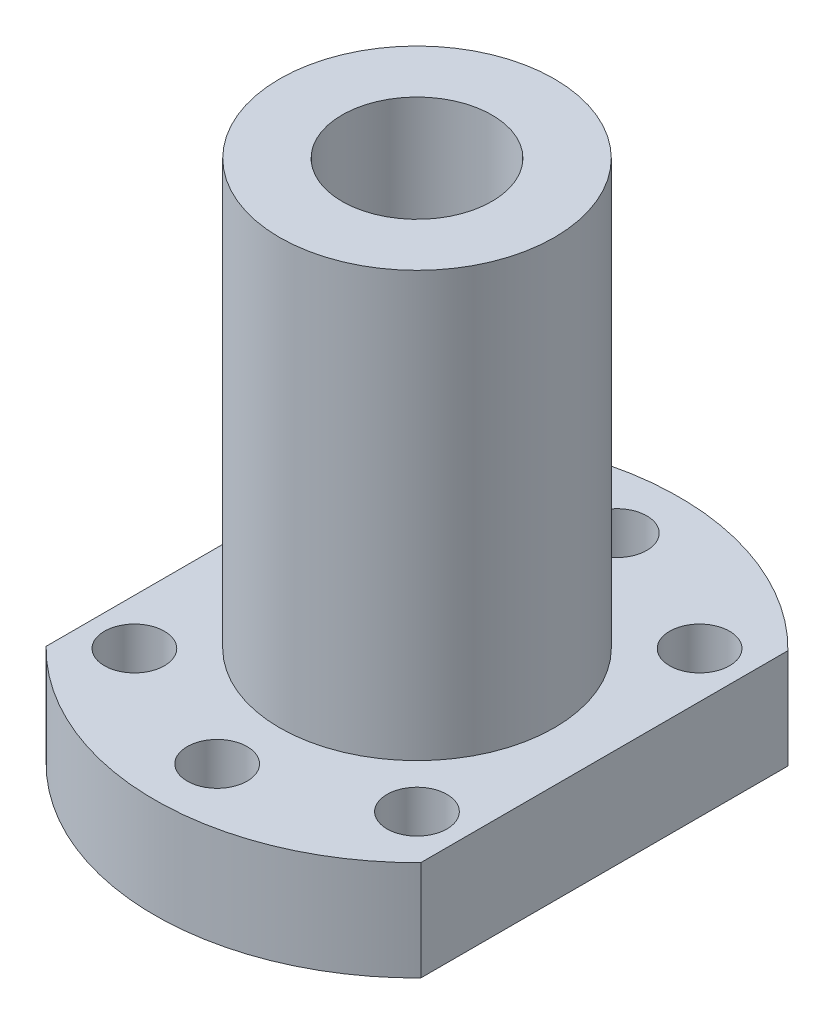
ISO-10303-21;
HEADER;
FILE_DESCRIPTION(('STEP AP214'),'2;1');
FILE_NAME('part.step','',(''),(''),'','','');
FILE_SCHEMA(('AUTOMOTIVE_DESIGN { 1 0 10303 214 1 1 1 1 }'));
ENDSEC;
DATA;
#1=APPLICATION_CONTEXT('core data for automotive mechanical design processes');
#2=APPLICATION_PROTOCOL_DEFINITION('international standard','automotive_design',2000,#1);
#3=PRODUCT_CONTEXT('',#1,'mechanical');
#4=PRODUCT('Part','Part','',(#3));
#5=PRODUCT_RELATED_PRODUCT_CATEGORY('part','',(#4));
#6=PRODUCT_DEFINITION_FORMATION('','',#4);
#7=PRODUCT_DEFINITION_CONTEXT('part definition',#1,'design');
#8=PRODUCT_DEFINITION('design','',#6,#7);
#9=PRODUCT_DEFINITION_SHAPE('','',#8);
#10=(LENGTH_UNIT() NAMED_UNIT(*) SI_UNIT(.MILLI.,.METRE.));
#11=(NAMED_UNIT(*) PLANE_ANGLE_UNIT() SI_UNIT($,.RADIAN.));
#12=(NAMED_UNIT(*) SI_UNIT($,.STERADIAN.) SOLID_ANGLE_UNIT());
#13=UNCERTAINTY_MEASURE_WITH_UNIT(LENGTH_MEASURE(1.E-05),#10,'distance_accuracy_value','');
#14=(GEOMETRIC_REPRESENTATION_CONTEXT(3) GLOBAL_UNCERTAINTY_ASSIGNED_CONTEXT((#13)) GLOBAL_UNIT_ASSIGNED_CONTEXT((#10,
#11,#12)) REPRESENTATION_CONTEXT('',''));
#15=CARTESIAN_POINT('',(0.,0.,0.));
#16=DIRECTION('',(0.,0.,1.));
#17=DIRECTION('',(1.,0.,0.));
#18=AXIS2_PLACEMENT_3D('',#15,#16,#17);
#19=CARTESIAN_POINT('',(15.,8.,0.));
#20=DIRECTION('',(1.,0.,0.));
#21=DIRECTION('',(0.,0.,-1.));
#22=AXIS2_PLACEMENT_3D('',#19,#20,#21);
#23=PLANE('',#22);
#24=DIRECTION('',(0.,0.,1.));
#25=VECTOR('',#24,1.);
#26=CARTESIAN_POINT('',(15.,0.,0.));
#27=LINE('',#26,#25);
#28=CARTESIAN_POINT('',(15.,0.,-14.6969384566991));
#29=VERTEX_POINT('',#28);
#30=CARTESIAN_POINT('',(15.,0.,14.6969384566991));
#31=VERTEX_POINT('',#30);
#32=EDGE_CURVE('E130',#29,#31,#27,.T.);
#33=ORIENTED_EDGE('',*,*,#32,.F.);
#34=DIRECTION('',(0.,-1.,0.));
#35=VECTOR('',#34,1.);
#36=CARTESIAN_POINT('',(15.,8.,-14.6969384566991));
#37=LINE('',#36,#35);
#38=CARTESIAN_POINT('',(15.,8.,-14.6969384566991));
#39=VERTEX_POINT('',#38);
#40=EDGE_CURVE('E11',#39,#29,#37,.T.);
#41=ORIENTED_EDGE('',*,*,#40,.F.);
#42=DIRECTION('',(0.,0.,1.));
#43=VECTOR('',#42,1.);
#44=CARTESIAN_POINT('',(15.,8.,0.));
#45=LINE('',#44,#43);
#46=CARTESIAN_POINT('',(15.,8.,14.6969384566991));
#47=VERTEX_POINT('',#46);
#48=EDGE_CURVE('E102',#39,#47,#45,.T.);
#49=ORIENTED_EDGE('',*,*,#48,.T.);
#50=DIRECTION('',(0.,-1.,0.));
#51=VECTOR('',#50,1.);
#52=CARTESIAN_POINT('',(15.,8.,14.6969384566991));
#53=LINE('',#52,#51);
#54=EDGE_CURVE('E83',#47,#31,#53,.T.);
#55=ORIENTED_EDGE('',*,*,#54,.T.);
#56=EDGE_LOOP('',(#33,#41,#49,#55));
#57=FACE_BOUND('',#56,.T.);
#58=ADVANCED_FACE('F38',(#57),#23,.T.);
#59=CARTESIAN_POINT('',(0.,8.,0.));
#60=DIRECTION('',(0.,-1.,0.));
#61=DIRECTION('',(0.,0.,-1.));
#62=AXIS2_PLACEMENT_3D('',#59,#60,#61);
#63=CYLINDRICAL_SURFACE('',#62,21.);
#64=CARTESIAN_POINT('',(0.,0.,0.));
#65=DIRECTION('',(0.,1.,0.));
#66=DIRECTION('',(0.,0.,1.));
#67=AXIS2_PLACEMENT_3D('',#64,#65,#66);
#68=CIRCLE('',#67,21.);
#69=CARTESIAN_POINT('',(-15.,0.,-14.6969384566991));
#70=VERTEX_POINT('',#69);
#71=EDGE_CURVE('E107',#29,#70,#68,.T.);
#72=ORIENTED_EDGE('',*,*,#71,.T.);
#73=DIRECTION('',(0.,-1.,0.));
#74=VECTOR('',#73,1.);
#75=CARTESIAN_POINT('',(-15.,8.,-14.6969384566991));
#76=LINE('',#75,#74);
#77=CARTESIAN_POINT('',(-15.,8.,-14.6969384566991));
#78=VERTEX_POINT('',#77);
#79=EDGE_CURVE('E53',#78,#70,#76,.T.);
#80=ORIENTED_EDGE('',*,*,#79,.F.);
#81=CARTESIAN_POINT('',(0.,8.,0.));
#82=DIRECTION('',(0.,1.,0.));
#83=DIRECTION('',(0.,0.,1.));
#84=AXIS2_PLACEMENT_3D('',#81,#82,#83);
#85=CIRCLE('',#84,21.);
#86=EDGE_CURVE('E98',#39,#78,#85,.T.);
#87=ORIENTED_EDGE('',*,*,#86,.F.);
#88=ORIENTED_EDGE('',*,*,#40,.T.);
#89=EDGE_LOOP('',(#72,#80,#87,#88));
#90=FACE_BOUND('',#89,.T.);
#91=ADVANCED_FACE('F105',(#90),#63,.T.);
#92=CARTESIAN_POINT('',(-15.,8.,0.));
#93=DIRECTION('',(1.,0.,0.));
#94=DIRECTION('',(0.,0.,-1.));
#95=AXIS2_PLACEMENT_3D('',#92,#93,#94);
#96=PLANE('',#95);
#97=CARTESIAN_POINT('',(-15.,4.,0.));
#98=DIRECTION('',(-1.,0.,0.));
#99=DIRECTION('',(0.,0.,1.));
#100=AXIS2_PLACEMENT_3D('',#97,#98,#99);
#101=CIRCLE('',#100,3.);
#102=CARTESIAN_POINT('',(-15.,4.,3.));
#103=VERTEX_POINT('',#102);
#104=EDGE_CURVE('E168',#103,#103,#101,.T.);
#105=ORIENTED_EDGE('',*,*,#104,.F.);
#106=EDGE_LOOP('',(#105));
#107=FACE_BOUND('',#106,.T.);
#108=DIRECTION('',(0.,0.,1.));
#109=VECTOR('',#108,1.);
#110=CARTESIAN_POINT('',(-15.,0.,0.));
#111=LINE('',#110,#109);
#112=CARTESIAN_POINT('',(-15.,0.,14.6969384566991));
#113=VERTEX_POINT('',#112);
#114=EDGE_CURVE('E127',#70,#113,#111,.T.);
#115=ORIENTED_EDGE('',*,*,#114,.T.);
#116=DIRECTION('',(0.,-1.,0.));
#117=VECTOR('',#116,1.);
#118=CARTESIAN_POINT('',(-15.,8.,14.6969384566991));
#119=LINE('',#118,#117);
#120=CARTESIAN_POINT('',(-15.,8.,14.6969384566991));
#121=VERTEX_POINT('',#120);
#122=EDGE_CURVE('E97',#121,#113,#119,.T.);
#123=ORIENTED_EDGE('',*,*,#122,.F.);
#124=DIRECTION('',(0.,0.,1.));
#125=VECTOR('',#124,1.);
#126=CARTESIAN_POINT('',(-15.,8.,0.));
#127=LINE('',#126,#125);
#128=EDGE_CURVE('E91',#78,#121,#127,.T.);
#129=ORIENTED_EDGE('',*,*,#128,.F.);
#130=ORIENTED_EDGE('',*,*,#79,.T.);
#131=EDGE_LOOP('',(#115,#123,#129,#130));
#132=FACE_BOUND('',#131,.T.);
#133=ADVANCED_FACE('F94',(#107,#132),#96,.F.);
#134=CARTESIAN_POINT('',(11.3137084989848,8.,11.3137084989847));
#135=DIRECTION('',(0.,-1.,0.));
#136=DIRECTION('',(0.,0.,-1.));
#137=AXIS2_PLACEMENT_3D('',#134,#135,#136);
#138=CYLINDRICAL_SURFACE('',#137,2.4);
#139=CARTESIAN_POINT('',(11.3137084989848,8.,11.3137084989847));
#140=DIRECTION('',(0.,1.,0.));
#141=DIRECTION('',(0.,0.,1.));
#142=AXIS2_PLACEMENT_3D('',#139,#140,#141);
#143=CIRCLE('',#142,2.4);
#144=CARTESIAN_POINT('',(11.3137084989848,8.,13.7137084989847));
#145=VERTEX_POINT('',#144);
#146=EDGE_CURVE('E141',#145,#145,#143,.F.);
#147=ORIENTED_EDGE('',*,*,#146,.F.);
#148=EDGE_LOOP('',(#147));
#149=FACE_BOUND('',#148,.T.);
#150=CARTESIAN_POINT('',(11.3137084989848,0.,11.3137084989847));
#151=DIRECTION('',(0.,1.,0.));
#152=DIRECTION('',(0.,0.,1.));
#153=AXIS2_PLACEMENT_3D('',#150,#151,#152);
#154=CIRCLE('',#153,2.4);
#155=CARTESIAN_POINT('',(11.3137084989848,0.,13.7137084989847));
#156=VERTEX_POINT('',#155);
#157=EDGE_CURVE('E117',#156,#156,#154,.F.);
#158=ORIENTED_EDGE('',*,*,#157,.T.);
#159=EDGE_LOOP('',(#158));
#160=FACE_BOUND('',#159,.T.);
#161=ADVANCED_FACE('F235',(#149,#160),#138,.F.);
#162=CARTESIAN_POINT('',(-11.3137084989848,8.,11.3137084989847));
#163=DIRECTION('',(0.,-1.,0.));
#164=DIRECTION('',(0.,0.,-1.));
#165=AXIS2_PLACEMENT_3D('',#162,#163,#164);
#166=CYLINDRICAL_SURFACE('',#165,2.4);
#167=CARTESIAN_POINT('',(-11.3137084989848,8.,11.3137084989847));
#168=DIRECTION('',(0.,1.,0.));
#169=DIRECTION('',(0.,0.,1.));
#170=AXIS2_PLACEMENT_3D('',#167,#168,#169);
#171=CIRCLE('',#170,2.4);
#172=CARTESIAN_POINT('',(-11.3137084989848,8.,13.7137084989847));
#173=VERTEX_POINT('',#172);
#174=EDGE_CURVE('E144',#173,#173,#171,.T.);
#175=ORIENTED_EDGE('',*,*,#174,.T.);
#176=EDGE_LOOP('',(#175));
#177=FACE_BOUND('',#176,.T.);
#178=CARTESIAN_POINT('',(-11.3137084989848,0.,11.3137084989847));
#179=DIRECTION('',(0.,1.,0.));
#180=DIRECTION('',(0.,0.,1.));
#181=AXIS2_PLACEMENT_3D('',#178,#179,#180);
#182=CIRCLE('',#181,2.4);
#183=CARTESIAN_POINT('',(-11.3137084989848,0.,13.7137084989847));
#184=VERTEX_POINT('',#183);
#185=EDGE_CURVE('E120',#184,#184,#182,.T.);
#186=ORIENTED_EDGE('',*,*,#185,.F.);
#187=EDGE_LOOP('',(#186));
#188=FACE_BOUND('',#187,.T.);
#189=ADVANCED_FACE('F238',(#177,#188),#166,.F.);
#190=CARTESIAN_POINT('',(0.,8.,16.));
#191=DIRECTION('',(0.,-1.,0.));
#192=DIRECTION('',(0.,0.,-1.));
#193=AXIS2_PLACEMENT_3D('',#190,#191,#192);
#194=CYLINDRICAL_SURFACE('',#193,2.4);
#195=CARTESIAN_POINT('',(0.,8.,16.));
#196=DIRECTION('',(0.,1.,0.));
#197=DIRECTION('',(0.,0.,1.));
#198=AXIS2_PLACEMENT_3D('',#195,#196,#197);
#199=CIRCLE('',#198,2.4);
#200=CARTESIAN_POINT('',(0.,8.,18.4));
#201=VERTEX_POINT('',#200);
#202=EDGE_CURVE('E147',#201,#201,#199,.T.);
#203=ORIENTED_EDGE('',*,*,#202,.T.);
#204=EDGE_LOOP('',(#203));
#205=FACE_BOUND('',#204,.T.);
#206=CARTESIAN_POINT('',(0.,0.,16.));
#207=DIRECTION('',(0.,1.,0.));
#208=DIRECTION('',(0.,0.,1.));
#209=AXIS2_PLACEMENT_3D('',#206,#207,#208);
#210=CIRCLE('',#209,2.4);
#211=CARTESIAN_POINT('',(0.,0.,18.4));
#212=VERTEX_POINT('',#211);
#213=EDGE_CURVE('E123',#212,#212,#210,.T.);
#214=ORIENTED_EDGE('',*,*,#213,.F.);
#215=EDGE_LOOP('',(#214));
#216=FACE_BOUND('',#215,.T.);
#217=ADVANCED_FACE('F214',(#205,#216),#194,.F.);
#218=CARTESIAN_POINT('',(0.,8.,0.));
#219=DIRECTION('',(0.,-1.,0.));
#220=DIRECTION('',(0.,0.,-1.));
#221=AXIS2_PLACEMENT_3D('',#218,#219,#220);
#222=CYLINDRICAL_SURFACE('',#221,21.);
#223=CARTESIAN_POINT('',(0.,0.,0.));
#224=DIRECTION('',(0.,1.,0.));
#225=DIRECTION('',(0.,0.,1.));
#226=AXIS2_PLACEMENT_3D('',#223,#224,#225);
#227=CIRCLE('',#226,21.);
#228=EDGE_CURVE('E76',#113,#31,#227,.T.);
#229=ORIENTED_EDGE('',*,*,#228,.T.);
#230=ORIENTED_EDGE('',*,*,#54,.F.);
#231=CARTESIAN_POINT('',(0.,8.,0.));
#232=DIRECTION('',(0.,1.,0.));
#233=DIRECTION('',(0.,0.,1.));
#234=AXIS2_PLACEMENT_3D('',#231,#232,#233);
#235=CIRCLE('',#234,21.);
#236=EDGE_CURVE('E61',#121,#47,#235,.T.);
#237=ORIENTED_EDGE('',*,*,#236,.F.);
#238=ORIENTED_EDGE('',*,*,#122,.T.);
#239=EDGE_LOOP('',(#229,#230,#237,#238));
#240=FACE_BOUND('',#239,.T.);
#241=ADVANCED_FACE('F207',(#240),#222,.T.);
#242=CARTESIAN_POINT('',(11.3137084989848,8.,-11.3137084989847));
#243=DIRECTION('',(0.,-1.,0.));
#244=DIRECTION('',(0.,0.,-1.));
#245=AXIS2_PLACEMENT_3D('',#242,#243,#244);
#246=CYLINDRICAL_SURFACE('',#245,2.4);
#247=CARTESIAN_POINT('',(11.3137084989848,8.,-11.3137084989847));
#248=DIRECTION('',(0.,1.,0.));
#249=DIRECTION('',(0.,0.,1.));
#250=AXIS2_PLACEMENT_3D('',#247,#248,#249);
#251=CIRCLE('',#250,2.4);
#252=CARTESIAN_POINT('',(11.3137084989848,8.,-8.91370849898474));
#253=VERTEX_POINT('',#252);
#254=EDGE_CURVE('E155',#253,#253,#251,.T.);
#255=ORIENTED_EDGE('',*,*,#254,.T.);
#256=EDGE_LOOP('',(#255));
#257=FACE_BOUND('',#256,.T.);
#258=CARTESIAN_POINT('',(11.3137084989848,0.,-11.3137084989847));
#259=DIRECTION('',(0.,1.,0.));
#260=DIRECTION('',(0.,0.,1.));
#261=AXIS2_PLACEMENT_3D('',#258,#259,#260);
#262=CIRCLE('',#261,2.4);
#263=CARTESIAN_POINT('',(11.3137084989848,0.,-8.91370849898474));
#264=VERTEX_POINT('',#263);
#265=EDGE_CURVE('E132',#264,#264,#262,.T.);
#266=ORIENTED_EDGE('',*,*,#265,.F.);
#267=EDGE_LOOP('',(#266));
#268=FACE_BOUND('',#267,.T.);
#269=ADVANCED_FACE('F205',(#257,#268),#246,.F.);
#270=CARTESIAN_POINT('',(0.,8.,-16.));
#271=DIRECTION('',(0.,-1.,0.));
#272=DIRECTION('',(0.,0.,-1.));
#273=AXIS2_PLACEMENT_3D('',#270,#271,#272);
#274=CYLINDRICAL_SURFACE('',#273,2.4);
#275=CARTESIAN_POINT('',(0.,8.,-16.));
#276=DIRECTION('',(0.,1.,0.));
#277=DIRECTION('',(0.,0.,1.));
#278=AXIS2_PLACEMENT_3D('',#275,#276,#277);
#279=CIRCLE('',#278,2.4);
#280=CARTESIAN_POINT('',(0.,8.,-13.6));
#281=VERTEX_POINT('',#280);
#282=EDGE_CURVE('E116',#281,#281,#279,.F.);
#283=ORIENTED_EDGE('',*,*,#282,.F.);
#284=EDGE_LOOP('',(#283));
#285=FACE_BOUND('',#284,.T.);
#286=CARTESIAN_POINT('',(0.,0.,-16.));
#287=DIRECTION('',(0.,1.,0.));
#288=DIRECTION('',(0.,0.,1.));
#289=AXIS2_PLACEMENT_3D('',#286,#287,#288);
#290=CIRCLE('',#289,2.4);
#291=CARTESIAN_POINT('',(0.,0.,-13.6));
#292=VERTEX_POINT('',#291);
#293=EDGE_CURVE('E135',#292,#292,#290,.F.);
#294=ORIENTED_EDGE('',*,*,#293,.T.);
#295=EDGE_LOOP('',(#294));
#296=FACE_BOUND('',#295,.T.);
#297=ADVANCED_FACE('F40',(#285,#296),#274,.F.);
#298=CARTESIAN_POINT('',(-11.3137084989848,8.,-11.3137084989847));
#299=DIRECTION('',(0.,-1.,0.));
#300=DIRECTION('',(0.,0.,-1.));
#301=AXIS2_PLACEMENT_3D('',#298,#299,#300);
#302=CYLINDRICAL_SURFACE('',#301,2.4);
#303=CARTESIAN_POINT('',(-11.3137084989848,8.,-11.3137084989847));
#304=DIRECTION('',(0.,1.,0.));
#305=DIRECTION('',(0.,0.,1.));
#306=AXIS2_PLACEMENT_3D('',#303,#304,#305);
#307=CIRCLE('',#306,2.4);
#308=CARTESIAN_POINT('',(-11.3137084989848,8.,-8.91370849898474));
#309=VERTEX_POINT('',#308);
#310=EDGE_CURVE('E112',#309,#309,#307,.F.);
#311=ORIENTED_EDGE('',*,*,#310,.F.);
#312=EDGE_LOOP('',(#311));
#313=FACE_BOUND('',#312,.T.);
#314=CARTESIAN_POINT('',(-11.3137084989848,0.,-11.3137084989847));
#315=DIRECTION('',(0.,1.,0.));
#316=DIRECTION('',(0.,0.,1.));
#317=AXIS2_PLACEMENT_3D('',#314,#315,#316);
#318=CIRCLE('',#317,2.4);
#319=CARTESIAN_POINT('',(-11.3137084989848,0.,-8.91370849898474));
#320=VERTEX_POINT('',#319);
#321=EDGE_CURVE('E113',#320,#320,#318,.F.);
#322=ORIENTED_EDGE('',*,*,#321,.T.);
#323=EDGE_LOOP('',(#322));
#324=FACE_BOUND('',#323,.T.);
#325=ADVANCED_FACE('F192',(#313,#324),#302,.F.);
#326=CARTESIAN_POINT('',(0.,8.,0.));
#327=DIRECTION('',(0.,1.,0.));
#328=DIRECTION('',(0.,0.,1.));
#329=AXIS2_PLACEMENT_3D('',#326,#327,#328);
#330=PLANE('',#329);
#331=ORIENTED_EDGE('',*,*,#282,.T.);
#332=EDGE_LOOP('',(#331));
#333=FACE_BOUND('',#332,.T.);
#334=ORIENTED_EDGE('',*,*,#254,.F.);
#335=EDGE_LOOP('',(#334));
#336=FACE_BOUND('',#335,.T.);
#337=ORIENTED_EDGE('',*,*,#48,.F.);
#338=ORIENTED_EDGE('',*,*,#86,.T.);
#339=ORIENTED_EDGE('',*,*,#128,.T.);
#340=ORIENTED_EDGE('',*,*,#236,.T.);
#341=EDGE_LOOP('',(#337,#338,#339,#340));
#342=FACE_BOUND('',#341,.T.);
#343=CARTESIAN_POINT('',(0.,8.,0.));
#344=DIRECTION('',(0.,1.,0.));
#345=DIRECTION('',(0.,0.,1.));
#346=AXIS2_PLACEMENT_3D('',#343,#344,#345);
#347=CIRCLE('',#346,11.);
#348=CARTESIAN_POINT('',(0.,8.,11.));
#349=VERTEX_POINT('',#348);
#350=EDGE_CURVE('E150',#349,#349,#347,.T.);
#351=ORIENTED_EDGE('',*,*,#350,.F.);
#352=EDGE_LOOP('',(#351));
#353=FACE_BOUND('',#352,.T.);
#354=ORIENTED_EDGE('',*,*,#202,.F.);
#355=EDGE_LOOP('',(#354));
#356=FACE_BOUND('',#355,.T.);
#357=ORIENTED_EDGE('',*,*,#174,.F.);
#358=EDGE_LOOP('',(#357));
#359=FACE_BOUND('',#358,.T.);
#360=ORIENTED_EDGE('',*,*,#146,.T.);
#361=EDGE_LOOP('',(#360));
#362=FACE_BOUND('',#361,.T.);
#363=ORIENTED_EDGE('',*,*,#310,.T.);
#364=EDGE_LOOP('',(#363));
#365=FACE_BOUND('',#364,.T.);
#366=ADVANCED_FACE('F100',(#333,#336,#342,#353,#356,#359,#362,#365),#330,.T.);
#367=CARTESIAN_POINT('',(0.,0.,0.));
#368=DIRECTION('',(0.,1.,0.));
#369=DIRECTION('',(0.,0.,1.));
#370=AXIS2_PLACEMENT_3D('',#367,#368,#369);
#371=PLANE('',#370);
#372=ORIENTED_EDGE('',*,*,#293,.F.);
#373=EDGE_LOOP('',(#372));
#374=FACE_BOUND('',#373,.T.);
#375=ORIENTED_EDGE('',*,*,#265,.T.);
#376=EDGE_LOOP('',(#375));
#377=FACE_BOUND('',#376,.T.);
#378=ORIENTED_EDGE('',*,*,#32,.T.);
#379=ORIENTED_EDGE('',*,*,#228,.F.);
#380=ORIENTED_EDGE('',*,*,#114,.F.);
#381=ORIENTED_EDGE('',*,*,#71,.F.);
#382=EDGE_LOOP('',(#378,#379,#380,#381));
#383=FACE_BOUND('',#382,.T.);
#384=ORIENTED_EDGE('',*,*,#213,.T.);
#385=EDGE_LOOP('',(#384));
#386=FACE_BOUND('',#385,.T.);
#387=ORIENTED_EDGE('',*,*,#185,.T.);
#388=EDGE_LOOP('',(#387));
#389=FACE_BOUND('',#388,.T.);
#390=ORIENTED_EDGE('',*,*,#157,.F.);
#391=EDGE_LOOP('',(#390));
#392=FACE_BOUND('',#391,.T.);
#393=ORIENTED_EDGE('',*,*,#321,.F.);
#394=EDGE_LOOP('',(#393));
#395=FACE_BOUND('',#394,.T.);
#396=CARTESIAN_POINT('',(0.,0.,0.));
#397=DIRECTION('',(0.,1.,0.));
#398=DIRECTION('',(0.,0.,1.));
#399=AXIS2_PLACEMENT_3D('',#396,#397,#398);
#400=CIRCLE('',#399,6.);
#401=CARTESIAN_POINT('',(0.,0.,6.));
#402=VERTEX_POINT('',#401);
#403=EDGE_CURVE('E160',#402,#402,#400,.T.);
#404=ORIENTED_EDGE('',*,*,#403,.T.);
#405=EDGE_LOOP('',(#404));
#406=FACE_BOUND('',#405,.T.);
#407=ADVANCED_FACE('F181',(#374,#377,#383,#386,#389,#392,#395,#406),#371,.F.);
#408=CARTESIAN_POINT('',(0.,42.,0.));
#409=DIRECTION('',(0.,-1.,0.));
#410=DIRECTION('',(0.,0.,-1.));
#411=AXIS2_PLACEMENT_3D('',#408,#409,#410);
#412=CYLINDRICAL_SURFACE('',#411,6.);
#413=CARTESIAN_POINT('',(-5.19615242270664,4.,3.));
#414=CARTESIAN_POINT('',(-5.19615338151414,3.9217997667409,2.99999910875738));
#415=CARTESIAN_POINT('',(-5.19792581191127,3.84359000153543,2.99693611207795));
#416=CARTESIAN_POINT('',(-5.20493931657123,3.68779192485795,2.98473565374509));
#417=CARTESIAN_POINT('',(-5.21018200566082,3.61020391973151,2.97559536411629));
#418=CARTESIAN_POINT('',(-5.23088200558207,3.37905598575357,2.9391691225804));
#419=CARTESIAN_POINT('',(-5.25131076607215,3.22724908946674,2.902878058149));
#420=CARTESIAN_POINT('',(-5.3024774692754,2.93360836647645,2.80829998089522));
#421=CARTESIAN_POINT('',(-5.33316051577918,2.79172619824911,2.75012989346617));
#422=CARTESIAN_POINT('',(-5.40128072966972,2.51973723829919,2.61380253964662));
#423=CARTESIAN_POINT('',(-5.43871826241347,2.38963108412508,2.53564419197538));
#424=CARTESIAN_POINT('',(-5.51990583559838,2.13307985385228,2.35399963256537));
#425=CARTESIAN_POINT('',(-5.56392184571631,2.00782179784408,2.24895611137364));
#426=CARTESIAN_POINT('',(-5.651159547025,1.77577563031046,2.01976141989962));
#427=CARTESIAN_POINT('',(-5.6943808324562,1.66899673174331,1.89560077655245));
#428=CARTESIAN_POINT('',(-5.77864428988887,1.46989831226767,1.62146869109162));
#429=CARTESIAN_POINT('',(-5.81934318752246,1.37903863407277,1.47032156718994));
#430=CARTESIAN_POINT('',(-5.89052268800541,1.22457750257193,1.1524710796464));
#431=CARTESIAN_POINT('',(-5.92100973690811,1.16095884675343,0.985777614653096));
#432=CARTESIAN_POINT('',(-5.96641383603058,1.06748600201083,0.654134831556289));
#433=CARTESIAN_POINT('',(-5.98228440595573,1.03555142035195,0.489905370480172));
#434=CARTESIAN_POINT('',(-6.00022751605263,0.999501644555989,0.157711887079237));
#435=CARTESIAN_POINT('',(-6.00230840492439,0.995369617867745,-0.0102498138110321));
#436=CARTESIAN_POINT('',(-5.9928894562274,1.01424003263481,-0.329497576667915));
#437=CARTESIAN_POINT('',(-5.98255487247966,1.03491408807805,-0.480963609704585));
#438=CARTESIAN_POINT('',(-5.9512273620779,1.09864249019649,-0.777941303579836));
#439=CARTESIAN_POINT('',(-5.93023363786808,1.14169851157788,-0.923452517976625));
#440=CARTESIAN_POINT('',(-5.87914748253372,1.24924785576957,-1.20692822064062));
#441=CARTESIAN_POINT('',(-5.8489331854518,1.31402953120064,-1.34476044303001));
#442=CARTESIAN_POINT('',(-5.78212944004645,1.46278965670795,-1.60793023199368));
#443=CARTESIAN_POINT('',(-5.74553771044373,1.54677497950966,-1.73326330217191));
#444=CARTESIAN_POINT('',(-5.66533158492102,1.74068847393954,-1.98052168794677));
#445=CARTESIAN_POINT('',(-5.62138031742825,1.85231851064165,-2.10100497271934));
#446=CARTESIAN_POINT('',(-5.53363118085844,2.09375974190886,-2.32231036115798));
#447=CARTESIAN_POINT('',(-5.48983345502613,2.22358479389568,-2.42311733790258));
#448=CARTESIAN_POINT('',(-5.40432084665524,2.50798214334072,-2.6085269546345));
#449=CARTESIAN_POINT('',(-5.36291485750667,2.66360243564598,-2.691694028528));
#450=CARTESIAN_POINT('',(-5.30915194408667,2.90756305461175,-2.79542837524198));
#451=CARTESIAN_POINT('',(-5.2926194649543,2.99065631040476,-2.82650797342001));
#452=CARTESIAN_POINT('',(-5.26298473463269,3.15980860303443,-2.88131297532033));
#453=CARTESIAN_POINT('',(-5.24988036897854,3.24586577447478,-2.90504291399185));
#454=CARTESIAN_POINT('',(-5.22855455988393,3.41337162022402,-2.94323927983803));
#455=CARTESIAN_POINT('',(-5.22002982263214,3.49464942563784,-2.95828810706486));
#456=CARTESIAN_POINT('',(-5.20672737157291,3.65843523866589,-2.98163903200842));
#457=CARTESIAN_POINT('',(-5.20194770920409,3.74094258374831,-2.98994463830254));
#458=CARTESIAN_POINT('',(-5.19633662863608,3.9064710068027,-2.99968663811345));
#459=CARTESIAN_POINT('',(-5.19550374026212,3.98949188194369,-3.00112558946313));
#460=CARTESIAN_POINT('',(-5.19780953199967,4.15528646076465,-2.99712742537403));
#461=CARTESIAN_POINT('',(-5.20094794403249,4.23806018075052,-2.99169077406597));
#462=CARTESIAN_POINT('',(-5.21504493010247,4.46685913604269,-2.96710135231213));
#463=CARTESIAN_POINT('',(-5.23019160660498,4.61191081026327,-2.9405616310018));
#464=CARTESIAN_POINT('',(-5.27081666384497,4.89513091079686,-2.8670906736223));
#465=CARTESIAN_POINT('',(-5.29629839028765,5.03329709183022,-2.82015283383764));
#466=CARTESIAN_POINT('',(-5.35608780273032,5.30622610391992,-2.70494224478443));
#467=CARTESIAN_POINT('',(-5.3907496041273,5.4405349279041,-2.63578205088436));
#468=CARTESIAN_POINT('',(-5.46468327792416,5.69640993836604,-2.47886133231339));
#469=CARTESIAN_POINT('',(-5.50395751387985,5.81796953081146,-2.39109125263821));
#470=CARTESIAN_POINT('',(-5.58864005140301,6.06093562663186,-2.186511456958));
#471=CARTESIAN_POINT('',(-5.63419752084738,6.18039127090002,-2.067435804994));
#472=CARTESIAN_POINT('',(-5.72202702310923,6.39823689529484,-1.8102134981498));
#473=CARTESIAN_POINT('',(-5.76429794308224,6.4966197596755,-1.67206042712515));
#474=CARTESIAN_POINT('',(-5.84224085806641,6.67172112757365,-1.3756060844338));
#475=CARTESIAN_POINT('',(-5.87770925226882,6.74779934188309,-1.21686929217556));
#476=CARTESIAN_POINT('',(-5.93650064667294,6.87141372431059,-0.886567094469553));
#477=CARTESIAN_POINT('',(-5.95983430919533,6.91897495484196,-0.715013103124012));
#478=CARTESIAN_POINT('',(-5.9900252464518,6.98010569184912,-0.380939047947202));
#479=CARTESIAN_POINT('',(-5.99819783930701,6.99639363556079,-0.219034335650396));
#480=CARTESIAN_POINT('',(-6.00126390919338,7.00252978843354,0.105377961951194));
#481=CARTESIAN_POINT('',(-5.99616203476054,6.99238725318317,0.267885316317455));
#482=CARTESIAN_POINT('',(-5.97401907190636,6.94775080986649,0.577613962536136));
#483=CARTESIAN_POINT('',(-5.95778686442443,6.91490556233434,0.72513690124772));
#484=CARTESIAN_POINT('',(-5.91576278551447,6.82801889196795,1.0123379087444));
#485=CARTESIAN_POINT('',(-5.88996954319457,6.77397442945753,1.15201484923628));
#486=CARTESIAN_POINT('',(-5.829778017116,6.64381927131126,1.42627001605163));
#487=CARTESIAN_POINT('',(-5.79505887623288,6.56686365846372,1.56037465678411));
#488=CARTESIAN_POINT('',(-5.7206436338201,6.39412457858644,1.81432469711302));
#489=CARTESIAN_POINT('',(-5.68094524943991,6.29833246401127,1.93416350676912));
#490=CARTESIAN_POINT('',(-5.5958597881944,6.07961527751646,2.16873884087781));
#491=CARTESIAN_POINT('',(-5.55029975504518,5.9549386792264,2.28178066887875));
#492=CARTESIAN_POINT('',(-5.46188649509677,5.68762167192987,2.48600225783028));
#493=CARTESIAN_POINT('',(-5.41903568750872,5.54496553896893,2.57716267726705));
#494=CARTESIAN_POINT('',(-5.36004774906989,5.31746820669823,2.69665559342489));
#495=CARTESIAN_POINT('',(-5.34101219148464,5.23802419901759,2.73405408762355));
#496=CARTESIAN_POINT('',(-5.30572783063718,5.0756467169913,2.80191257626505));
#497=CARTESIAN_POINT('',(-5.28947759301444,4.992715066252,2.83237614466584));
#498=CARTESIAN_POINT('',(-5.26045215868186,4.82415526763026,2.88592624586958));
#499=CARTESIAN_POINT('',(-5.24766803509091,4.73853469275865,2.90903175649394));
#500=CARTESIAN_POINT('',(-5.22608869625113,4.56514474468575,2.9476242805163));
#501=CARTESIAN_POINT('',(-5.21729069243665,4.47737691907938,2.96311662049621));
#502=CARTESIAN_POINT('',(-5.20588528016134,4.32460118224006,2.9830938122572));
#503=CARTESIAN_POINT('',(-5.20224442588138,4.25990519109302,2.9894274622838));
#504=CARTESIAN_POINT('',(-5.19737751744686,4.13014168320032,2.99788106792142));
#505=CARTESIAN_POINT('',(-5.1961516248372,4.0650741418924,3.00000074164547));
#506=CARTESIAN_POINT('',(-5.19615242270664,4.,3.));
#507=B_SPLINE_CURVE_WITH_KNOTS('',3,(#413,#414,#415,#416,#417,#418,#419,#420,#421,#422,#423,
#424,#425,#426,#427,#428,#429,#430,#431,#432,#433,#434,#435,#436,#437,#438,#439,#440,#441,#442,
#443,#444,#445,#446,#447,#448,#449,#450,#451,#452,#453,#454,#455,#456,#457,#458,#459,#460,#461,
#462,#463,#464,#465,#466,#467,#468,#469,#470,#471,#472,#473,#474,#475,#476,#477,#478,#479,#480,
#481,#482,#483,#484,#485,#486,#487,#488,#489,#490,#491,#492,#493,#494,#495,#496,#497,#498,#499,
#500,#501,#502,#503,#504,#505,#506),.UNSPECIFIED.,.T.,.F.,(4,2,2,2,2,2,2,2,2,2,2,2,2,2,2,2,2,2,
2,2,2,2,2,2,2,2,2,2,2,2,2,2,2,2,2,2,2,2,2,2,2,2,2,2,2,2,4),(0.,0.234529430733891,
0.469168072604262,0.93885038329453,1.40605749261242,1.87328988121656,2.37905864237581,
2.88507883741224,3.42520847204401,3.96499651379784,4.46637625391917,4.96745241546231,
5.42495462941726,5.88249108040477,6.34635774681551,6.81039068538927,7.31828744858783,
7.82657315225867,8.36713695676456,8.63752916119813,8.90775419202326,9.15669600787592,
9.40550821320572,9.65422772860785,9.90293045534218,10.3454331624118,10.7880792327729,
11.2512265518736,11.7146122462924,12.2364099671094,12.7583836090371,13.29413310208,
13.8294110539541,14.3155757713756,14.8015702635101,15.2555404058358,15.7095756650514,
16.1830301812751,16.6567025627126,17.177514915193,17.6987859450456,17.9680115893229,
18.2370981707631,18.5054849980178,18.7736837791728,18.9688338446807,19.1639969639894),.UNSPECIFIED.);
#508=CARTESIAN_POINT('',(-5.19615242270664,4.,3.));
#509=VERTEX_POINT('',#508);
#510=EDGE_CURVE('E42',#509,#509,#507,.T.);
#511=ORIENTED_EDGE('',*,*,#510,.F.);
#512=EDGE_LOOP('',(#511));
#513=FACE_BOUND('',#512,.T.);
#514=CARTESIAN_POINT('',(0.,42.,0.));
#515=DIRECTION('',(0.,1.,0.));
#516=DIRECTION('',(0.,0.,1.));
#517=AXIS2_PLACEMENT_3D('',#514,#515,#516);
#518=CIRCLE('',#517,6.);
#519=CARTESIAN_POINT('',(0.,42.,6.));
#520=VERTEX_POINT('',#519);
#521=EDGE_CURVE('E163',#520,#520,#518,.T.);
#522=ORIENTED_EDGE('',*,*,#521,.T.);
#523=EDGE_LOOP('',(#522));
#524=FACE_BOUND('',#523,.T.);
#525=ORIENTED_EDGE('',*,*,#403,.F.);
#526=EDGE_LOOP('',(#525));
#527=FACE_BOUND('',#526,.T.);
#528=ADVANCED_FACE('F177',(#513,#524,#527),#412,.F.);
#529=CARTESIAN_POINT('',(0.,42.,0.));
#530=DIRECTION('',(0.,-1.,0.));
#531=DIRECTION('',(0.,0.,-1.));
#532=AXIS2_PLACEMENT_3D('',#529,#530,#531);
#533=CYLINDRICAL_SURFACE('',#532,11.);
#534=ORIENTED_EDGE('',*,*,#350,.T.);
#535=EDGE_LOOP('',(#534));
#536=FACE_BOUND('',#535,.T.);
#537=CARTESIAN_POINT('',(0.,42.,0.));
#538=DIRECTION('',(0.,1.,0.));
#539=DIRECTION('',(0.,0.,1.));
#540=AXIS2_PLACEMENT_3D('',#537,#538,#539);
#541=CIRCLE('',#540,11.);
#542=CARTESIAN_POINT('',(0.,42.,11.));
#543=VERTEX_POINT('',#542);
#544=EDGE_CURVE('E138',#543,#543,#541,.T.);
#545=ORIENTED_EDGE('',*,*,#544,.F.);
#546=EDGE_LOOP('',(#545));
#547=FACE_BOUND('',#546,.T.);
#548=ADVANCED_FACE('F180',(#536,#547),#533,.T.);
#549=CARTESIAN_POINT('',(0.,42.,0.));
#550=DIRECTION('',(0.,1.,0.));
#551=DIRECTION('',(0.,0.,1.));
#552=AXIS2_PLACEMENT_3D('',#549,#550,#551);
#553=PLANE('',#552);
#554=ORIENTED_EDGE('',*,*,#521,.F.);
#555=EDGE_LOOP('',(#554));
#556=FACE_BOUND('',#555,.T.);
#557=ORIENTED_EDGE('',*,*,#544,.T.);
#558=EDGE_LOOP('',(#557));
#559=FACE_BOUND('',#558,.T.);
#560=ADVANCED_FACE('F303',(#556,#559),#553,.T.);
#561=CARTESIAN_POINT('',(5.00000000000001,4.,0.));
#562=DIRECTION('',(-1.,0.,0.));
#563=DIRECTION('',(0.,0.,1.));
#564=AXIS2_PLACEMENT_3D('',#561,#562,#563);
#565=CYLINDRICAL_SURFACE('',#564,3.);
#566=ORIENTED_EDGE('',*,*,#510,.T.);
#567=EDGE_LOOP('',(#566));
#568=FACE_BOUND('',#567,.T.);
#569=ORIENTED_EDGE('',*,*,#104,.T.);
#570=EDGE_LOOP('',(#569));
#571=FACE_BOUND('',#570,.T.);
#572=ADVANCED_FACE('F175',(#568,#571),#565,.F.);
#573=CLOSED_SHELL('',(#58,#91,#133,#161,#189,#217,#241,#269,#297,#325,#366,#407,#528,#548,#560,#572));
#574=MANIFOLD_SOLID_BREP('B2',#573);
#575=ADVANCED_BREP_SHAPE_REPRESENTATION('',(#18,#574),#14);
#576=SHAPE_DEFINITION_REPRESENTATION(#9,#575);
ENDSEC;
END-ISO-10303-21;
